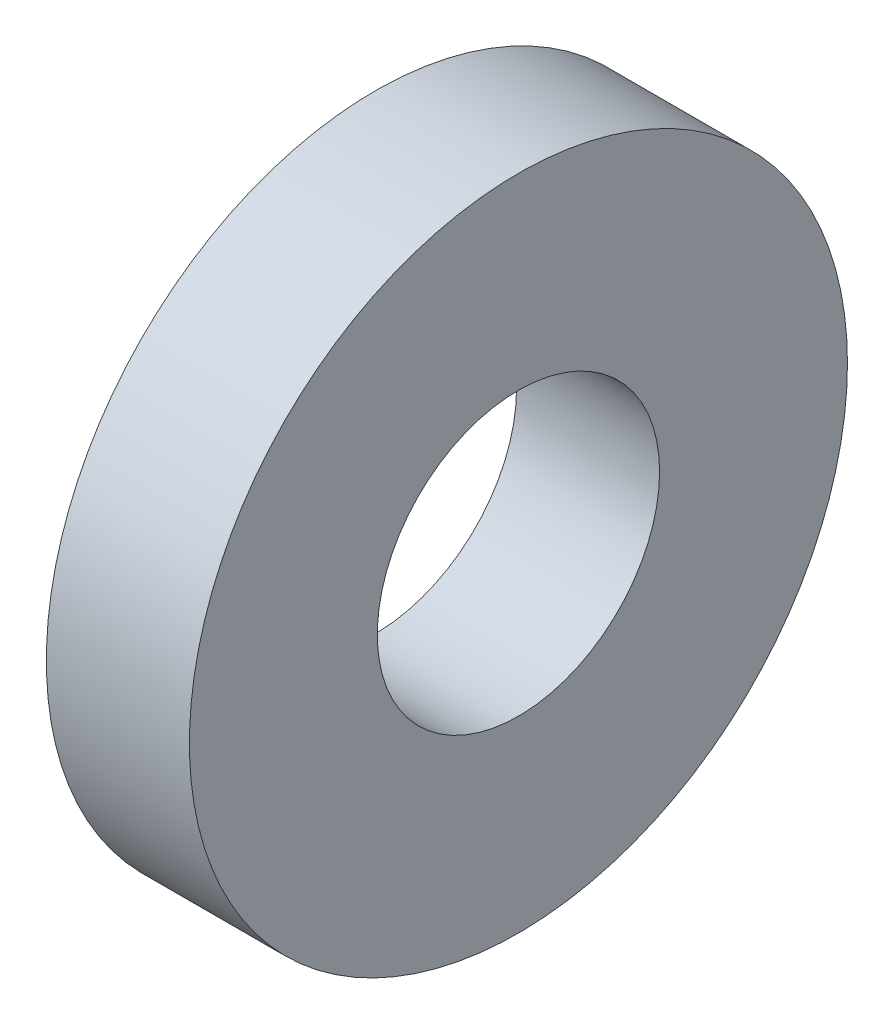
ISO-10303-21;
HEADER;
FILE_DESCRIPTION(('STEP AP214'),'2;1');
FILE_NAME('part.step','',(''),(''),'','','');
FILE_SCHEMA(('AUTOMOTIVE_DESIGN { 1 0 10303 214 1 1 1 1 }'));
ENDSEC;
DATA;
#1=APPLICATION_CONTEXT('core data for automotive mechanical design processes');
#2=APPLICATION_PROTOCOL_DEFINITION('international standard','automotive_design',2000,#1);
#3=PRODUCT_CONTEXT('',#1,'mechanical');
#4=PRODUCT('Part','Part','',(#3));
#5=PRODUCT_RELATED_PRODUCT_CATEGORY('part','',(#4));
#6=PRODUCT_DEFINITION_FORMATION('','',#4);
#7=PRODUCT_DEFINITION_CONTEXT('part definition',#1,'design');
#8=PRODUCT_DEFINITION('design','',#6,#7);
#9=PRODUCT_DEFINITION_SHAPE('','',#8);
#10=(LENGTH_UNIT() NAMED_UNIT(*) SI_UNIT(.MILLI.,.METRE.));
#11=(NAMED_UNIT(*) PLANE_ANGLE_UNIT() SI_UNIT($,.RADIAN.));
#12=(NAMED_UNIT(*) SI_UNIT($,.STERADIAN.) SOLID_ANGLE_UNIT());
#13=UNCERTAINTY_MEASURE_WITH_UNIT(LENGTH_MEASURE(1.E-05),#10,'distance_accuracy_value','');
#14=(GEOMETRIC_REPRESENTATION_CONTEXT(3) GLOBAL_UNCERTAINTY_ASSIGNED_CONTEXT((#13)) GLOBAL_UNIT_ASSIGNED_CONTEXT((#10,
#11,#12)) REPRESENTATION_CONTEXT('',''));
#15=CARTESIAN_POINT('',(0.,0.,0.));
#16=DIRECTION('',(0.,0.,1.));
#17=DIRECTION('',(1.,0.,0.));
#18=AXIS2_PLACEMENT_3D('',#15,#16,#17);
#19=CARTESIAN_POINT('',(1.5,0.,0.));
#20=DIRECTION('',(1.,0.,0.));
#21=DIRECTION('',(0.,0.,-1.));
#22=AXIS2_PLACEMENT_3D('',#19,#20,#21);
#23=PLANE('',#22);
#24=CARTESIAN_POINT('',(1.5,0.,0.));
#25=DIRECTION('',(1.,0.,0.));
#26=DIRECTION('',(0.,0.,-1.));
#27=AXIS2_PLACEMENT_3D('',#24,#25,#26);
#28=CIRCLE('',#27,3.45);
#29=CARTESIAN_POINT('',(1.5,0.,-3.45));
#30=VERTEX_POINT('',#29);
#31=EDGE_CURVE('E10',#30,#30,#28,.T.);
#32=ORIENTED_EDGE('',*,*,#31,.T.);
#33=EDGE_LOOP('',(#32));
#34=FACE_BOUND('',#33,.T.);
#35=CARTESIAN_POINT('',(1.5,0.,0.));
#36=DIRECTION('',(1.,0.,0.));
#37=DIRECTION('',(0.,0.,-1.));
#38=AXIS2_PLACEMENT_3D('',#35,#36,#37);
#39=CIRCLE('',#38,1.48);
#40=CARTESIAN_POINT('',(1.5,0.,-1.48));
#41=VERTEX_POINT('',#40);
#42=EDGE_CURVE('E45',#41,#41,#39,.T.);
#43=ORIENTED_EDGE('',*,*,#42,.F.);
#44=EDGE_LOOP('',(#43));
#45=FACE_BOUND('',#44,.T.);
#46=ADVANCED_FACE('F34',(#34,#45),#23,.T.);
#47=CARTESIAN_POINT('',(0.,0.,0.));
#48=DIRECTION('',(1.,0.,0.));
#49=DIRECTION('',(0.,0.,-1.));
#50=AXIS2_PLACEMENT_3D('',#47,#48,#49);
#51=PLANE('',#50);
#52=CARTESIAN_POINT('',(0.,0.,0.));
#53=DIRECTION('',(1.,0.,0.));
#54=DIRECTION('',(0.,0.,-1.));
#55=AXIS2_PLACEMENT_3D('',#52,#53,#54);
#56=CIRCLE('',#55,3.45);
#57=CARTESIAN_POINT('',(0.,0.,-3.45));
#58=VERTEX_POINT('',#57);
#59=EDGE_CURVE('E38',#58,#58,#56,.T.);
#60=ORIENTED_EDGE('',*,*,#59,.F.);
#61=EDGE_LOOP('',(#60));
#62=FACE_BOUND('',#61,.T.);
#63=CARTESIAN_POINT('',(0.,0.,0.));
#64=DIRECTION('',(1.,0.,0.));
#65=DIRECTION('',(0.,0.,-1.));
#66=AXIS2_PLACEMENT_3D('',#63,#64,#65);
#67=CIRCLE('',#66,1.48);
#68=CARTESIAN_POINT('',(0.,0.,-1.48));
#69=VERTEX_POINT('',#68);
#70=EDGE_CURVE('E47',#69,#69,#67,.T.);
#71=ORIENTED_EDGE('',*,*,#70,.T.);
#72=EDGE_LOOP('',(#71));
#73=FACE_BOUND('',#72,.T.);
#74=ADVANCED_FACE('F57',(#62,#73),#51,.F.);
#75=CARTESIAN_POINT('',(1.5,0.,0.));
#76=DIRECTION('',(-1.,0.,0.));
#77=DIRECTION('',(0.,0.,1.));
#78=AXIS2_PLACEMENT_3D('',#75,#76,#77);
#79=CYLINDRICAL_SURFACE('',#78,3.45);
#80=ORIENTED_EDGE('',*,*,#31,.F.);
#81=EDGE_LOOP('',(#80));
#82=FACE_BOUND('',#81,.T.);
#83=ORIENTED_EDGE('',*,*,#59,.T.);
#84=EDGE_LOOP('',(#83));
#85=FACE_BOUND('',#84,.T.);
#86=ADVANCED_FACE('F36',(#82,#85),#79,.T.);
#87=CARTESIAN_POINT('',(1.5,0.,0.));
#88=DIRECTION('',(-1.,0.,0.));
#89=DIRECTION('',(0.,0.,1.));
#90=AXIS2_PLACEMENT_3D('',#87,#88,#89);
#91=CYLINDRICAL_SURFACE('',#90,1.48);
#92=ORIENTED_EDGE('',*,*,#42,.T.);
#93=EDGE_LOOP('',(#92));
#94=FACE_BOUND('',#93,.T.);
#95=ORIENTED_EDGE('',*,*,#70,.F.);
#96=EDGE_LOOP('',(#95));
#97=FACE_BOUND('',#96,.T.);
#98=ADVANCED_FACE('F53',(#94,#97),#91,.F.);
#99=CLOSED_SHELL('',(#46,#74,#86,#98));
#100=MANIFOLD_SOLID_BREP('B2',#99);
#101=ADVANCED_BREP_SHAPE_REPRESENTATION('',(#18,#100),#14);
#102=SHAPE_DEFINITION_REPRESENTATION(#9,#101);
ENDSEC;
END-ISO-10303-21;
